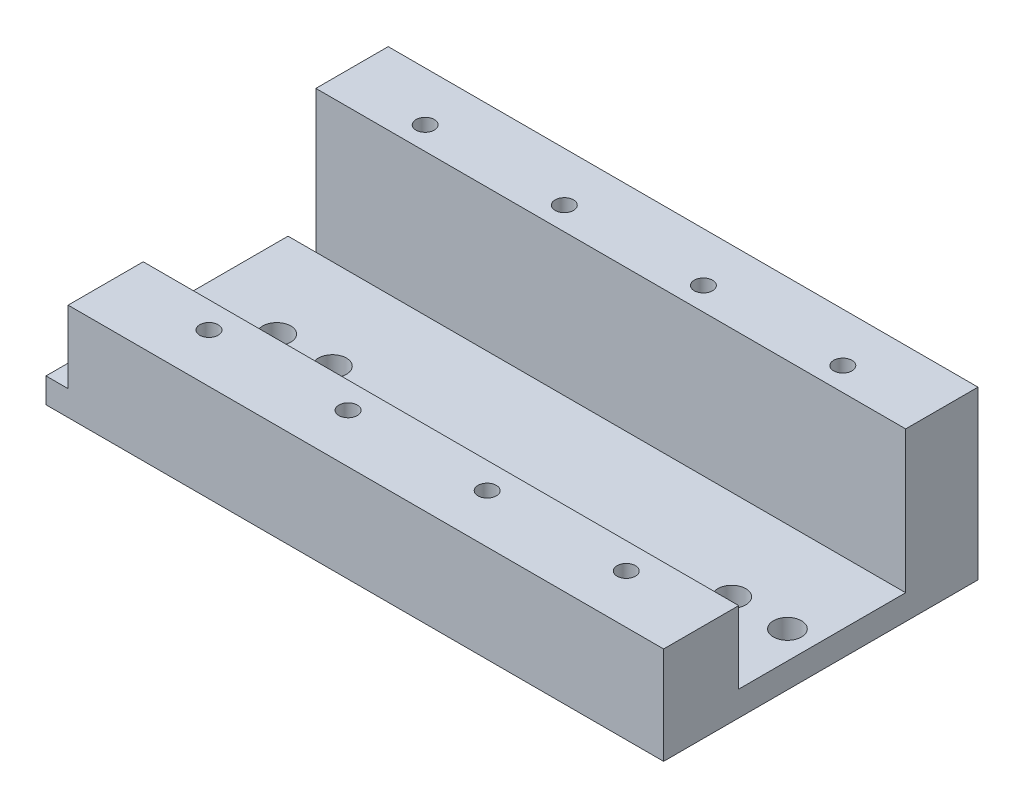
ISO-10303-21;
HEADER;
FILE_DESCRIPTION(('STEP AP214'),'2;1');
FILE_NAME('part.step','',(''),(''),'','','');
FILE_SCHEMA(('AUTOMOTIVE_DESIGN { 1 0 10303 214 1 1 1 1 }'));
ENDSEC;
DATA;
#1=APPLICATION_CONTEXT('core data for automotive mechanical design processes');
#2=APPLICATION_PROTOCOL_DEFINITION('international standard','automotive_design',2000,#1);
#3=PRODUCT_CONTEXT('',#1,'mechanical');
#4=PRODUCT('Part','Part','',(#3));
#5=PRODUCT_RELATED_PRODUCT_CATEGORY('part','',(#4));
#6=PRODUCT_DEFINITION_FORMATION('','',#4);
#7=PRODUCT_DEFINITION_CONTEXT('part definition',#1,'design');
#8=PRODUCT_DEFINITION('design','',#6,#7);
#9=PRODUCT_DEFINITION_SHAPE('','',#8);
#10=(LENGTH_UNIT() NAMED_UNIT(*) SI_UNIT(.MILLI.,.METRE.));
#11=(NAMED_UNIT(*) PLANE_ANGLE_UNIT() SI_UNIT($,.RADIAN.));
#12=(NAMED_UNIT(*) SI_UNIT($,.STERADIAN.) SOLID_ANGLE_UNIT());
#13=UNCERTAINTY_MEASURE_WITH_UNIT(LENGTH_MEASURE(1.E-05),#10,'distance_accuracy_value','');
#14=(GEOMETRIC_REPRESENTATION_CONTEXT(3) GLOBAL_UNCERTAINTY_ASSIGNED_CONTEXT((#13)) GLOBAL_UNIT_ASSIGNED_CONTEXT((#10,
#11,#12)) REPRESENTATION_CONTEXT('',''));
#15=CARTESIAN_POINT('',(0.,0.,0.));
#16=DIRECTION('',(0.,0.,1.));
#17=DIRECTION('',(1.,0.,0.));
#18=AXIS2_PLACEMENT_3D('',#15,#16,#17);
#19=CARTESIAN_POINT('',(-89.8910476017454,-50.3227629134366,-13.));
#20=DIRECTION('',(0.,-1.,0.));
#21=DIRECTION('',(0.,0.,-1.));
#22=AXIS2_PLACEMENT_3D('',#19,#20,#21);
#23=PLANE('',#22);
#24=CARTESIAN_POINT('',(-74.3910476017454,-50.3227629134366,34.71));
#25=DIRECTION('',(0.,-1.,0.));
#26=DIRECTION('',(0.,0.,-1.));
#27=AXIS2_PLACEMENT_3D('',#24,#25,#26);
#28=CIRCLE('',#27,1.65);
#29=CARTESIAN_POINT('',(-74.3910476017454,-50.3227629134366,33.06));
#30=VERTEX_POINT('',#29);
#31=EDGE_CURVE('E374',#30,#30,#28,.F.);
#32=ORIENTED_EDGE('',*,*,#31,.T.);
#33=EDGE_LOOP('',(#32));
#34=FACE_BOUND('',#33,.T.);
#35=CARTESIAN_POINT('',(-49.3910476017454,-50.3227629134366,34.71));
#36=DIRECTION('',(0.,-1.,0.));
#37=DIRECTION('',(0.,0.,-1.));
#38=AXIS2_PLACEMENT_3D('',#35,#36,#37);
#39=CIRCLE('',#38,1.65);
#40=CARTESIAN_POINT('',(-49.3910476017454,-50.3227629134366,33.06));
#41=VERTEX_POINT('',#40);
#42=EDGE_CURVE('E384',#41,#41,#39,.F.);
#43=ORIENTED_EDGE('',*,*,#42,.T.);
#44=EDGE_LOOP('',(#43));
#45=FACE_BOUND('',#44,.T.);
#46=CARTESIAN_POINT('',(0.608952398254592,-50.3227629134366,34.71));
#47=DIRECTION('',(0.,-1.,0.));
#48=DIRECTION('',(0.,0.,-1.));
#49=AXIS2_PLACEMENT_3D('',#46,#47,#48);
#50=CIRCLE('',#49,1.65);
#51=CARTESIAN_POINT('',(0.608952398254592,-50.3227629134366,33.06));
#52=VERTEX_POINT('',#51);
#53=EDGE_CURVE('E396',#52,#52,#50,.F.);
#54=ORIENTED_EDGE('',*,*,#53,.T.);
#55=EDGE_LOOP('',(#54));
#56=FACE_BOUND('',#55,.T.);
#57=CARTESIAN_POINT('',(-80.6690739035055,-50.3227629134366,16.25));
#58=DIRECTION('',(0.,1.,0.));
#59=DIRECTION('',(0.,0.,1.));
#60=AXIS2_PLACEMENT_3D('',#57,#58,#59);
#61=CIRCLE('',#60,2.5273);
#62=CARTESIAN_POINT('',(-80.6690739035055,-50.3227629134366,18.7773));
#63=VERTEX_POINT('',#62);
#64=EDGE_CURVE('E145',#63,#63,#61,.T.);
#65=ORIENTED_EDGE('',*,*,#64,.T.);
#66=EDGE_LOOP('',(#65));
#67=FACE_BOUND('',#66,.T.);
#68=CARTESIAN_POINT('',(11.1089523982546,-50.3227629134366,16.25));
#69=DIRECTION('',(0.,1.,0.));
#70=DIRECTION('',(0.,0.,1.));
#71=AXIS2_PLACEMENT_3D('',#68,#69,#70);
#72=CIRCLE('',#71,2.5273);
#73=CARTESIAN_POINT('',(11.1089523982546,-50.3227629134366,18.7773));
#74=VERTEX_POINT('',#73);
#75=EDGE_CURVE('E156',#74,#74,#72,.T.);
#76=ORIENTED_EDGE('',*,*,#75,.T.);
#77=EDGE_LOOP('',(#76));
#78=FACE_BOUND('',#77,.T.);
#79=CARTESIAN_POINT('',(1.10895239825459,-50.3227629134366,16.25));
#80=DIRECTION('',(0.,1.,0.));
#81=DIRECTION('',(0.,0.,1.));
#82=AXIS2_PLACEMENT_3D('',#79,#80,#81);
#83=CIRCLE('',#82,2.5273);
#84=CARTESIAN_POINT('',(1.10895239825459,-50.3227629134366,18.7773));
#85=VERTEX_POINT('',#84);
#86=EDGE_CURVE('E162',#85,#85,#83,.T.);
#87=ORIENTED_EDGE('',*,*,#86,.T.);
#88=EDGE_LOOP('',(#87));
#89=FACE_BOUND('',#88,.T.);
#90=CARTESIAN_POINT('',(-70.6690739035055,-50.3227629134366,16.25));
#91=DIRECTION('',(0.,1.,0.));
#92=DIRECTION('',(0.,0.,1.));
#93=AXIS2_PLACEMENT_3D('',#90,#91,#92);
#94=CIRCLE('',#93,2.5273);
#95=CARTESIAN_POINT('',(-70.6690739035055,-50.3227629134366,18.7773));
#96=VERTEX_POINT('',#95);
#97=EDGE_CURVE('E168',#96,#96,#94,.T.);
#98=ORIENTED_EDGE('',*,*,#97,.T.);
#99=EDGE_LOOP('',(#98));
#100=FACE_BOUND('',#99,.T.);
#101=CARTESIAN_POINT('',(-74.3909856023909,-50.3227629134366,-4.15));
#102=DIRECTION('',(0.,1.,0.));
#103=DIRECTION('',(0.,0.,1.));
#104=AXIS2_PLACEMENT_3D('',#101,#102,#103);
#105=CIRCLE('',#104,1.65);
#106=CARTESIAN_POINT('',(-74.3909856023909,-50.3227629134366,-2.5));
#107=VERTEX_POINT('',#106);
#108=EDGE_CURVE('E202',#107,#107,#105,.T.);
#109=ORIENTED_EDGE('',*,*,#108,.T.);
#110=EDGE_LOOP('',(#109));
#111=FACE_BOUND('',#110,.T.);
#112=CARTESIAN_POINT('',(-49.3909856023909,-50.3227629134366,-4.15));
#113=DIRECTION('',(0.,1.,0.));
#114=DIRECTION('',(0.,0.,1.));
#115=AXIS2_PLACEMENT_3D('',#112,#113,#114);
#116=CIRCLE('',#115,1.64999999999999);
#117=CARTESIAN_POINT('',(-49.3909856023909,-50.3227629134366,-2.50000000000001));
#118=VERTEX_POINT('',#117);
#119=EDGE_CURVE('E208',#118,#118,#116,.T.);
#120=ORIENTED_EDGE('',*,*,#119,.T.);
#121=EDGE_LOOP('',(#120));
#122=FACE_BOUND('',#121,.T.);
#123=CARTESIAN_POINT('',(0.608952398254592,-50.3227629134366,-4.20567731927571));
#124=DIRECTION('',(0.,1.,0.));
#125=DIRECTION('',(0.,0.,1.));
#126=AXIS2_PLACEMENT_3D('',#123,#124,#125);
#127=CIRCLE('',#126,1.64999999999999);
#128=CARTESIAN_POINT('',(0.608952398254592,-50.3227629134366,-2.55567731927571));
#129=VERTEX_POINT('',#128);
#130=EDGE_CURVE('E214',#129,#129,#127,.T.);
#131=ORIENTED_EDGE('',*,*,#130,.T.);
#132=EDGE_LOOP('',(#131));
#133=FACE_BOUND('',#132,.T.);
#134=CARTESIAN_POINT('',(-24.3909856023909,-50.3227629134366,-4.15));
#135=DIRECTION('',(0.,1.,0.));
#136=DIRECTION('',(0.,0.,1.));
#137=AXIS2_PLACEMENT_3D('',#134,#135,#136);
#138=CIRCLE('',#137,1.64999999999999);
#139=CARTESIAN_POINT('',(-24.3909856023909,-50.3227629134366,-2.50000000000001));
#140=VERTEX_POINT('',#139);
#141=EDGE_CURVE('E220',#140,#140,#138,.T.);
#142=ORIENTED_EDGE('',*,*,#141,.T.);
#143=EDGE_LOOP('',(#142));
#144=FACE_BOUND('',#143,.T.);
#145=DIRECTION('',(0.,0.,1.));
#146=VECTOR('',#145,1.);
#147=CARTESIAN_POINT('',(16.1089523982546,-50.3227629134366,-13.));
#148=LINE('',#147,#146);
#149=CARTESIAN_POINT('',(16.1089523982546,-50.3227629134366,-13.));
#150=VERTEX_POINT('',#149);
#151=CARTESIAN_POINT('',(16.1089523982546,-50.3227629134366,43.5));
#152=VERTEX_POINT('',#151);
#153=EDGE_CURVE('E244',#150,#152,#148,.T.);
#154=ORIENTED_EDGE('',*,*,#153,.T.);
#155=DIRECTION('',(1.,0.,0.));
#156=VECTOR('',#155,1.);
#157=CARTESIAN_POINT('',(-89.8910476017454,-50.3227629134366,43.5));
#158=LINE('',#157,#156);
#159=CARTESIAN_POINT('',(-94.8910476017454,-50.3227629134366,43.5));
#160=VERTEX_POINT('',#159);
#161=EDGE_CURVE('E192',#160,#152,#158,.T.);
#162=ORIENTED_EDGE('',*,*,#161,.F.);
#163=DIRECTION('',(0.,0.,1.));
#164=VECTOR('',#163,1.);
#165=CARTESIAN_POINT('',(-94.8910476017454,-50.3227629134366,0.));
#166=LINE('',#165,#164);
#167=CARTESIAN_POINT('',(-94.8910476017454,-50.3227629134366,0.));
#168=VERTEX_POINT('',#167);
#169=EDGE_CURVE('E175',#168,#160,#166,.T.);
#170=ORIENTED_EDGE('',*,*,#169,.F.);
#171=DIRECTION('',(1.,0.,0.));
#172=VECTOR('',#171,1.);
#173=CARTESIAN_POINT('',(-94.8910476017454,-50.3227629134366,0.));
#174=LINE('',#173,#172);
#175=CARTESIAN_POINT('',(-89.8910476017454,-50.3227629134366,0.));
#176=VERTEX_POINT('',#175);
#177=EDGE_CURVE('E188',#168,#176,#174,.T.);
#178=ORIENTED_EDGE('',*,*,#177,.T.);
#179=DIRECTION('',(0.,0.,1.));
#180=VECTOR('',#179,1.);
#181=CARTESIAN_POINT('',(-89.8910476017454,-50.3227629134366,-13.));
#182=LINE('',#181,#180);
#183=CARTESIAN_POINT('',(-89.8910476017454,-50.3227629134366,-13.));
#184=VERTEX_POINT('',#183);
#185=EDGE_CURVE('E40',#184,#176,#182,.T.);
#186=ORIENTED_EDGE('',*,*,#185,.F.);
#187=DIRECTION('',(1.,0.,0.));
#188=VECTOR('',#187,1.);
#189=CARTESIAN_POINT('',(-89.8910476017454,-50.3227629134366,-13.));
#190=LINE('',#189,#188);
#191=EDGE_CURVE('E227',#184,#150,#190,.T.);
#192=ORIENTED_EDGE('',*,*,#191,.T.);
#193=EDGE_LOOP('',(#154,#162,#170,#178,#186,#192));
#194=FACE_BOUND('',#193,.T.);
#195=CARTESIAN_POINT('',(-24.3910476017454,-50.3227629134366,34.71));
#196=DIRECTION('',(0.,-1.,0.));
#197=DIRECTION('',(0.,0.,-1.));
#198=AXIS2_PLACEMENT_3D('',#195,#196,#197);
#199=CIRCLE('',#198,1.65);
#200=CARTESIAN_POINT('',(-24.3910476017454,-50.3227629134366,33.06));
#201=VERTEX_POINT('',#200);
#202=EDGE_CURVE('E390',#201,#201,#199,.F.);
#203=ORIENTED_EDGE('',*,*,#202,.T.);
#204=EDGE_LOOP('',(#203));
#205=FACE_BOUND('',#204,.T.);
#206=ADVANCED_FACE('F36',(#34,#45,#56,#67,#78,#89,#100,#111,#122,#133,#144,#194,#205),#23,.T.);
#207=CARTESIAN_POINT('',(-89.8910476017454,-45.8227629134366,43.5));
#208=DIRECTION('',(0.,-1.,0.));
#209=DIRECTION('',(0.,0.,-1.));
#210=AXIS2_PLACEMENT_3D('',#207,#208,#209);
#211=PLANE('',#210);
#212=CARTESIAN_POINT('',(-70.6690739035055,-45.8227629134366,16.25));
#213=DIRECTION('',(0.,1.,0.));
#214=DIRECTION('',(0.,0.,1.));
#215=AXIS2_PLACEMENT_3D('',#212,#213,#214);
#216=CIRCLE('',#215,2.52729999999998);
#217=CARTESIAN_POINT('',(-70.6690739035055,-45.8227629134366,18.7773));
#218=VERTEX_POINT('',#217);
#219=EDGE_CURVE('E165',#218,#218,#216,.T.);
#220=ORIENTED_EDGE('',*,*,#219,.F.);
#221=EDGE_LOOP('',(#220));
#222=FACE_BOUND('',#221,.T.);
#223=CARTESIAN_POINT('',(1.10895239825459,-45.8227629134366,16.25));
#224=DIRECTION('',(0.,1.,0.));
#225=DIRECTION('',(0.,0.,1.));
#226=AXIS2_PLACEMENT_3D('',#223,#224,#225);
#227=CIRCLE('',#226,2.52729999999999);
#228=CARTESIAN_POINT('',(1.10895239825459,-45.8227629134366,18.7773));
#229=VERTEX_POINT('',#228);
#230=EDGE_CURVE('E159',#229,#229,#227,.T.);
#231=ORIENTED_EDGE('',*,*,#230,.F.);
#232=EDGE_LOOP('',(#231));
#233=FACE_BOUND('',#232,.T.);
#234=CARTESIAN_POINT('',(11.1089523982546,-45.8227629134366,16.25));
#235=DIRECTION('',(0.,1.,0.));
#236=DIRECTION('',(0.,0.,1.));
#237=AXIS2_PLACEMENT_3D('',#234,#235,#236);
#238=CIRCLE('',#237,2.52729999999999);
#239=CARTESIAN_POINT('',(11.1089523982546,-45.8227629134366,18.7773));
#240=VERTEX_POINT('',#239);
#241=EDGE_CURVE('E153',#240,#240,#238,.T.);
#242=ORIENTED_EDGE('',*,*,#241,.F.);
#243=EDGE_LOOP('',(#242));
#244=FACE_BOUND('',#243,.T.);
#245=CARTESIAN_POINT('',(-80.6690739035055,-45.8227629134366,16.25));
#246=DIRECTION('',(0.,1.,0.));
#247=DIRECTION('',(0.,0.,1.));
#248=AXIS2_PLACEMENT_3D('',#245,#246,#247);
#249=CIRCLE('',#248,2.52729999999998);
#250=CARTESIAN_POINT('',(-80.6690739035055,-45.8227629134366,18.7773));
#251=VERTEX_POINT('',#250);
#252=EDGE_CURVE('E141',#251,#251,#249,.T.);
#253=ORIENTED_EDGE('',*,*,#252,.F.);
#254=EDGE_LOOP('',(#253));
#255=FACE_BOUND('',#254,.T.);
#256=DIRECTION('',(0.,0.,1.));
#257=VECTOR('',#256,1.);
#258=CARTESIAN_POINT('',(-90.9181293095313,-45.8227629134366,43.5));
#259=LINE('',#258,#257);
#260=CARTESIAN_POINT('',(-90.9181293095313,-45.8227629134366,30.));
#261=VERTEX_POINT('',#260);
#262=CARTESIAN_POINT('',(-90.9181293095313,-45.8227629134366,43.5));
#263=VERTEX_POINT('',#262);
#264=EDGE_CURVE('E53',#261,#263,#259,.T.);
#265=ORIENTED_EDGE('',*,*,#264,.F.);
#266=DIRECTION('',(-1.,0.,0.));
#267=VECTOR('',#266,1.);
#268=CARTESIAN_POINT('',(-90.9181293095313,-45.8227629134366,30.));
#269=LINE('',#268,#267);
#270=CARTESIAN_POINT('',(16.1089523982546,-45.8227629134366,30.));
#271=VERTEX_POINT('',#270);
#272=EDGE_CURVE('E138',#271,#261,#269,.T.);
#273=ORIENTED_EDGE('',*,*,#272,.F.);
#274=DIRECTION('',(0.,0.,-1.));
#275=VECTOR('',#274,1.);
#276=CARTESIAN_POINT('',(16.1089523982546,-45.8227629134366,43.5));
#277=LINE('',#276,#275);
#278=CARTESIAN_POINT('',(16.1089523982546,-45.8227629134366,0.));
#279=VERTEX_POINT('',#278);
#280=EDGE_CURVE('E61',#271,#279,#277,.T.);
#281=ORIENTED_EDGE('',*,*,#280,.T.);
#282=DIRECTION('',(-1.,0.,0.));
#283=VECTOR('',#282,1.);
#284=CARTESIAN_POINT('',(-89.8910476017454,-45.8227629134366,0.));
#285=LINE('',#284,#283);
#286=CARTESIAN_POINT('',(-89.8910476017454,-45.8227629134366,0.));
#287=VERTEX_POINT('',#286);
#288=EDGE_CURVE('E191',#279,#287,#285,.T.);
#289=ORIENTED_EDGE('',*,*,#288,.T.);
#290=DIRECTION('',(1.,0.,0.));
#291=VECTOR('',#290,1.);
#292=CARTESIAN_POINT('',(-94.8910476017454,-45.8227629134366,0.));
#293=LINE('',#292,#291);
#294=CARTESIAN_POINT('',(-94.8910476017454,-45.8227629134366,0.));
#295=VERTEX_POINT('',#294);
#296=EDGE_CURVE('E183',#295,#287,#293,.T.);
#297=ORIENTED_EDGE('',*,*,#296,.F.);
#298=DIRECTION('',(0.,0.,-1.));
#299=VECTOR('',#298,1.);
#300=CARTESIAN_POINT('',(-94.8910476017454,-45.8227629134366,0.));
#301=LINE('',#300,#299);
#302=CARTESIAN_POINT('',(-94.8910476017454,-45.8227629134366,43.5));
#303=VERTEX_POINT('',#302);
#304=EDGE_CURVE('E181',#303,#295,#301,.T.);
#305=ORIENTED_EDGE('',*,*,#304,.F.);
#306=DIRECTION('',(-1.,0.,0.));
#307=VECTOR('',#306,1.);
#308=CARTESIAN_POINT('',(-89.8910476017454,-45.8227629134366,43.5));
#309=LINE('',#308,#307);
#310=EDGE_CURVE('E195',#263,#303,#309,.T.);
#311=ORIENTED_EDGE('',*,*,#310,.F.);
#312=EDGE_LOOP('',(#265,#273,#281,#289,#297,#305,#311));
#313=FACE_BOUND('',#312,.T.);
#314=ADVANCED_FACE('F257',(#222,#233,#244,#255,#313),#211,.F.);
#315=CARTESIAN_POINT('',(-89.8910476017454,-20.3227629134366,-13.));
#316=DIRECTION('',(-1.,0.,0.));
#317=DIRECTION('',(0.,0.,1.));
#318=AXIS2_PLACEMENT_3D('',#315,#316,#317);
#319=PLANE('',#318);
#320=DIRECTION('',(0.,-1.,0.));
#321=VECTOR('',#320,1.);
#322=CARTESIAN_POINT('',(-89.8910476017454,-45.8227629134366,0.));
#323=LINE('',#322,#321);
#324=EDGE_CURVE('E171',#287,#176,#323,.T.);
#325=ORIENTED_EDGE('',*,*,#324,.F.);
#326=DIRECTION('',(0.,-1.,0.));
#327=VECTOR('',#326,1.);
#328=CARTESIAN_POINT('',(-89.8910476017454,-20.3227629134366,0.));
#329=LINE('',#328,#327);
#330=CARTESIAN_POINT('',(-89.8910476017454,-20.3227629134366,0.));
#331=VERTEX_POINT('',#330);
#332=EDGE_CURVE('E223',#331,#287,#329,.T.);
#333=ORIENTED_EDGE('',*,*,#332,.F.);
#334=DIRECTION('',(0.,0.,1.));
#335=VECTOR('',#334,1.);
#336=CARTESIAN_POINT('',(-89.8910476017454,-20.3227629134366,-13.));
#337=LINE('',#336,#335);
#338=CARTESIAN_POINT('',(-89.8910476017454,-20.3227629134366,-13.));
#339=VERTEX_POINT('',#338);
#340=EDGE_CURVE('E11',#339,#331,#337,.T.);
#341=ORIENTED_EDGE('',*,*,#340,.F.);
#342=DIRECTION('',(0.,-1.,0.));
#343=VECTOR('',#342,1.);
#344=CARTESIAN_POINT('',(-89.8910476017454,-20.3227629134366,-13.));
#345=LINE('',#344,#343);
#346=EDGE_CURVE('E224',#339,#184,#345,.T.);
#347=ORIENTED_EDGE('',*,*,#346,.T.);
#348=ORIENTED_EDGE('',*,*,#185,.T.);
#349=EDGE_LOOP('',(#325,#333,#341,#347,#348));
#350=FACE_BOUND('',#349,.T.);
#351=ADVANCED_FACE('F38',(#350),#319,.T.);
#352=CARTESIAN_POINT('',(-89.8910476017454,-20.3227629134366,-13.));
#353=DIRECTION('',(0.,1.,0.));
#354=DIRECTION('',(0.,0.,1.));
#355=AXIS2_PLACEMENT_3D('',#352,#353,#354);
#356=PLANE('',#355);
#357=CARTESIAN_POINT('',(-74.3909856023909,-20.3227629134366,-4.15));
#358=DIRECTION('',(0.,1.,0.));
#359=DIRECTION('',(0.,0.,1.));
#360=AXIS2_PLACEMENT_3D('',#357,#358,#359);
#361=CIRCLE('',#360,1.65);
#362=CARTESIAN_POINT('',(-74.3909856023909,-20.3227629134366,-2.5));
#363=VERTEX_POINT('',#362);
#364=EDGE_CURVE('E199',#363,#363,#361,.T.);
#365=ORIENTED_EDGE('',*,*,#364,.F.);
#366=EDGE_LOOP('',(#365));
#367=FACE_BOUND('',#366,.T.);
#368=CARTESIAN_POINT('',(-49.3909856023909,-20.3227629134366,-4.15));
#369=DIRECTION('',(0.,1.,0.));
#370=DIRECTION('',(0.,0.,1.));
#371=AXIS2_PLACEMENT_3D('',#368,#369,#370);
#372=CIRCLE('',#371,1.65);
#373=CARTESIAN_POINT('',(-49.3909856023909,-20.3227629134366,-2.5));
#374=VERTEX_POINT('',#373);
#375=EDGE_CURVE('E205',#374,#374,#372,.T.);
#376=ORIENTED_EDGE('',*,*,#375,.F.);
#377=EDGE_LOOP('',(#376));
#378=FACE_BOUND('',#377,.T.);
#379=CARTESIAN_POINT('',(0.608952398254592,-20.3227629134366,-4.20567731927571));
#380=DIRECTION('',(0.,1.,0.));
#381=DIRECTION('',(0.,0.,1.));
#382=AXIS2_PLACEMENT_3D('',#379,#380,#381);
#383=CIRCLE('',#382,1.65);
#384=CARTESIAN_POINT('',(0.608952398254592,-20.3227629134366,-2.55567731927571));
#385=VERTEX_POINT('',#384);
#386=EDGE_CURVE('E211',#385,#385,#383,.T.);
#387=ORIENTED_EDGE('',*,*,#386,.F.);
#388=EDGE_LOOP('',(#387));
#389=FACE_BOUND('',#388,.T.);
#390=CARTESIAN_POINT('',(-24.3909856023909,-20.3227629134366,-4.15));
#391=DIRECTION('',(0.,1.,0.));
#392=DIRECTION('',(0.,0.,1.));
#393=AXIS2_PLACEMENT_3D('',#390,#391,#392);
#394=CIRCLE('',#393,1.65);
#395=CARTESIAN_POINT('',(-24.3909856023909,-20.3227629134366,-2.5));
#396=VERTEX_POINT('',#395);
#397=EDGE_CURVE('E217',#396,#396,#394,.T.);
#398=ORIENTED_EDGE('',*,*,#397,.F.);
#399=EDGE_LOOP('',(#398));
#400=FACE_BOUND('',#399,.T.);
#401=DIRECTION('',(-1.,0.,0.));
#402=VECTOR('',#401,1.);
#403=CARTESIAN_POINT('',(-89.8910476017454,-20.3227629134366,0.));
#404=LINE('',#403,#402);
#405=CARTESIAN_POINT('',(16.1089523982546,-20.3227629134366,0.));
#406=VERTEX_POINT('',#405);
#407=EDGE_CURVE('E228',#406,#331,#404,.T.);
#408=ORIENTED_EDGE('',*,*,#407,.F.);
#409=DIRECTION('',(0.,0.,1.));
#410=VECTOR('',#409,1.);
#411=CARTESIAN_POINT('',(16.1089523982546,-20.3227629134366,-13.));
#412=LINE('',#411,#410);
#413=CARTESIAN_POINT('',(16.1089523982546,-20.3227629134366,-13.));
#414=VERTEX_POINT('',#413);
#415=EDGE_CURVE('E45',#414,#406,#412,.T.);
#416=ORIENTED_EDGE('',*,*,#415,.F.);
#417=DIRECTION('',(-1.,0.,0.));
#418=VECTOR('',#417,1.);
#419=CARTESIAN_POINT('',(-89.8910476017454,-20.3227629134366,-13.));
#420=LINE('',#419,#418);
#421=EDGE_CURVE('E234',#414,#339,#420,.T.);
#422=ORIENTED_EDGE('',*,*,#421,.T.);
#423=ORIENTED_EDGE('',*,*,#340,.T.);
#424=EDGE_LOOP('',(#408,#416,#422,#423));
#425=FACE_BOUND('',#424,.T.);
#426=ADVANCED_FACE('F268',(#367,#378,#389,#400,#425),#356,.T.);
#427=CARTESIAN_POINT('',(16.1089523982546,-20.3227629134366,-13.));
#428=DIRECTION('',(1.,0.,0.));
#429=DIRECTION('',(0.,0.,-1.));
#430=AXIS2_PLACEMENT_3D('',#427,#428,#429);
#431=PLANE('',#430);
#432=DIRECTION('',(0.,1.,0.));
#433=VECTOR('',#432,1.);
#434=CARTESIAN_POINT('',(16.1089523982546,-20.3227629134366,0.));
#435=LINE('',#434,#433);
#436=EDGE_CURVE('E239',#279,#406,#435,.T.);
#437=ORIENTED_EDGE('',*,*,#436,.F.);
#438=ORIENTED_EDGE('',*,*,#280,.F.);
#439=DIRECTION('',(0.,-1.,0.));
#440=VECTOR('',#439,1.);
#441=CARTESIAN_POINT('',(16.1089523982546,-32.8227629134366,30.));
#442=LINE('',#441,#440);
#443=CARTESIAN_POINT('',(16.1089523982546,-32.8227629134366,30.));
#444=VERTEX_POINT('',#443);
#445=EDGE_CURVE('E142',#444,#271,#442,.T.);
#446=ORIENTED_EDGE('',*,*,#445,.F.);
#447=DIRECTION('',(0.,0.,-1.));
#448=VECTOR('',#447,1.);
#449=CARTESIAN_POINT('',(16.1089523982546,-32.8227629134366,43.5));
#450=LINE('',#449,#448);
#451=CARTESIAN_POINT('',(16.1089523982546,-32.8227629134366,43.5));
#452=VERTEX_POINT('',#451);
#453=EDGE_CURVE('E130',#452,#444,#450,.T.);
#454=ORIENTED_EDGE('',*,*,#453,.F.);
#455=DIRECTION('',(0.,1.,0.));
#456=VECTOR('',#455,1.);
#457=CARTESIAN_POINT('',(16.1089523982546,-45.8227629134366,43.5));
#458=LINE('',#457,#456);
#459=EDGE_CURVE('E127',#152,#452,#458,.T.);
#460=ORIENTED_EDGE('',*,*,#459,.F.);
#461=ORIENTED_EDGE('',*,*,#153,.F.);
#462=DIRECTION('',(0.,1.,0.));
#463=VECTOR('',#462,1.);
#464=CARTESIAN_POINT('',(16.1089523982546,-20.3227629134366,-13.));
#465=LINE('',#464,#463);
#466=EDGE_CURVE('E231',#150,#414,#465,.T.);
#467=ORIENTED_EDGE('',*,*,#466,.T.);
#468=ORIENTED_EDGE('',*,*,#415,.T.);
#469=EDGE_LOOP('',(#437,#438,#446,#454,#460,#461,#467,#468));
#470=FACE_BOUND('',#469,.T.);
#471=ADVANCED_FACE('F262',(#470),#431,.T.);
#472=CARTESIAN_POINT('',(0.,0.,-13.));
#473=DIRECTION('',(0.,0.,1.));
#474=DIRECTION('',(1.,0.,0.));
#475=AXIS2_PLACEMENT_3D('',#472,#473,#474);
#476=PLANE('',#475);
#477=ORIENTED_EDGE('',*,*,#346,.F.);
#478=ORIENTED_EDGE('',*,*,#421,.F.);
#479=ORIENTED_EDGE('',*,*,#466,.F.);
#480=ORIENTED_EDGE('',*,*,#191,.F.);
#481=EDGE_LOOP('',(#477,#478,#479,#480));
#482=FACE_BOUND('',#481,.T.);
#483=ADVANCED_FACE('F270',(#482),#476,.F.);
#484=CARTESIAN_POINT('',(0.,0.,0.));
#485=DIRECTION('',(0.,0.,1.));
#486=DIRECTION('',(1.,0.,0.));
#487=AXIS2_PLACEMENT_3D('',#484,#485,#486);
#488=PLANE('',#487);
#489=ORIENTED_EDGE('',*,*,#288,.F.);
#490=ORIENTED_EDGE('',*,*,#436,.T.);
#491=ORIENTED_EDGE('',*,*,#407,.T.);
#492=ORIENTED_EDGE('',*,*,#332,.T.);
#493=EDGE_LOOP('',(#489,#490,#491,#492));
#494=FACE_BOUND('',#493,.T.);
#495=ADVANCED_FACE('F260',(#494),#488,.T.);
#496=CARTESIAN_POINT('',(-24.3909856023909,-20.3227629134366,-4.15));
#497=DIRECTION('',(0.,1.,0.));
#498=DIRECTION('',(0.,0.,1.));
#499=AXIS2_PLACEMENT_3D('',#496,#497,#498);
#500=CYLINDRICAL_SURFACE('',#499,1.64999999999999);
#501=ORIENTED_EDGE('',*,*,#141,.F.);
#502=EDGE_LOOP('',(#501));
#503=FACE_BOUND('',#502,.T.);
#504=ORIENTED_EDGE('',*,*,#397,.T.);
#505=EDGE_LOOP('',(#504));
#506=FACE_BOUND('',#505,.T.);
#507=ADVANCED_FACE('F277',(#503,#506),#500,.F.);
#508=CARTESIAN_POINT('',(0.608952398254592,-20.3227629134366,-4.20567731927571));
#509=DIRECTION('',(0.,1.,0.));
#510=DIRECTION('',(0.,0.,1.));
#511=AXIS2_PLACEMENT_3D('',#508,#509,#510);
#512=CYLINDRICAL_SURFACE('',#511,1.64999999999999);
#513=ORIENTED_EDGE('',*,*,#130,.F.);
#514=EDGE_LOOP('',(#513));
#515=FACE_BOUND('',#514,.T.);
#516=ORIENTED_EDGE('',*,*,#386,.T.);
#517=EDGE_LOOP('',(#516));
#518=FACE_BOUND('',#517,.T.);
#519=ADVANCED_FACE('F305',(#515,#518),#512,.F.);
#520=CARTESIAN_POINT('',(-49.3909856023909,-20.3227629134366,-4.15));
#521=DIRECTION('',(0.,1.,0.));
#522=DIRECTION('',(0.,0.,1.));
#523=AXIS2_PLACEMENT_3D('',#520,#521,#522);
#524=CYLINDRICAL_SURFACE('',#523,1.65);
#525=ORIENTED_EDGE('',*,*,#119,.F.);
#526=EDGE_LOOP('',(#525));
#527=FACE_BOUND('',#526,.T.);
#528=ORIENTED_EDGE('',*,*,#375,.T.);
#529=EDGE_LOOP('',(#528));
#530=FACE_BOUND('',#529,.T.);
#531=ADVANCED_FACE('F310',(#527,#530),#524,.F.);
#532=CARTESIAN_POINT('',(-74.3909856023909,-20.3227629134366,-4.15));
#533=DIRECTION('',(0.,1.,0.));
#534=DIRECTION('',(0.,0.,1.));
#535=AXIS2_PLACEMENT_3D('',#532,#533,#534);
#536=CYLINDRICAL_SURFACE('',#535,1.65);
#537=ORIENTED_EDGE('',*,*,#108,.F.);
#538=EDGE_LOOP('',(#537));
#539=FACE_BOUND('',#538,.T.);
#540=ORIENTED_EDGE('',*,*,#364,.T.);
#541=EDGE_LOOP('',(#540));
#542=FACE_BOUND('',#541,.T.);
#543=ADVANCED_FACE('F317',(#539,#542),#536,.F.);
#544=CARTESIAN_POINT('',(0.,0.,43.5));
#545=DIRECTION('',(0.,0.,1.));
#546=DIRECTION('',(1.,0.,0.));
#547=AXIS2_PLACEMENT_3D('',#544,#545,#546);
#548=PLANE('',#547);
#549=ORIENTED_EDGE('',*,*,#459,.T.);
#550=DIRECTION('',(1.,0.,0.));
#551=VECTOR('',#550,1.);
#552=CARTESIAN_POINT('',(-90.9181293095313,-32.8227629134366,43.5));
#553=LINE('',#552,#551);
#554=CARTESIAN_POINT('',(-90.9181293095313,-32.8227629134366,43.5));
#555=VERTEX_POINT('',#554);
#556=EDGE_CURVE('E120',#555,#452,#553,.T.);
#557=ORIENTED_EDGE('',*,*,#556,.F.);
#558=DIRECTION('',(0.,-1.,0.));
#559=VECTOR('',#558,1.);
#560=CARTESIAN_POINT('',(-90.9181293095313,-32.8227629134366,43.5));
#561=LINE('',#560,#559);
#562=EDGE_CURVE('E123',#555,#263,#561,.T.);
#563=ORIENTED_EDGE('',*,*,#562,.T.);
#564=ORIENTED_EDGE('',*,*,#310,.T.);
#565=DIRECTION('',(0.,1.,0.));
#566=VECTOR('',#565,1.);
#567=CARTESIAN_POINT('',(-94.8910476017454,-45.8227629134366,43.5));
#568=LINE('',#567,#566);
#569=EDGE_CURVE('E178',#160,#303,#568,.T.);
#570=ORIENTED_EDGE('',*,*,#569,.F.);
#571=ORIENTED_EDGE('',*,*,#161,.T.);
#572=EDGE_LOOP('',(#549,#557,#563,#564,#570,#571));
#573=FACE_BOUND('',#572,.T.);
#574=ADVANCED_FACE('F122',(#573),#548,.T.);
#575=CARTESIAN_POINT('',(-94.8910476017454,-45.8227629134366,0.));
#576=DIRECTION('',(0.,0.,1.));
#577=DIRECTION('',(1.,0.,0.));
#578=AXIS2_PLACEMENT_3D('',#575,#576,#577);
#579=PLANE('',#578);
#580=ORIENTED_EDGE('',*,*,#324,.T.);
#581=ORIENTED_EDGE('',*,*,#177,.F.);
#582=DIRECTION('',(0.,-1.,0.));
#583=VECTOR('',#582,1.);
#584=CARTESIAN_POINT('',(-94.8910476017454,-45.8227629134366,0.));
#585=LINE('',#584,#583);
#586=EDGE_CURVE('E172',#295,#168,#585,.T.);
#587=ORIENTED_EDGE('',*,*,#586,.F.);
#588=ORIENTED_EDGE('',*,*,#296,.T.);
#589=EDGE_LOOP('',(#580,#581,#587,#588));
#590=FACE_BOUND('',#589,.T.);
#591=ADVANCED_FACE('F254',(#590),#579,.F.);
#592=CARTESIAN_POINT('',(-94.8910476017454,0.,0.));
#593=DIRECTION('',(-1.,0.,0.));
#594=DIRECTION('',(0.,0.,1.));
#595=AXIS2_PLACEMENT_3D('',#592,#593,#594);
#596=PLANE('',#595);
#597=ORIENTED_EDGE('',*,*,#586,.T.);
#598=ORIENTED_EDGE('',*,*,#169,.T.);
#599=ORIENTED_EDGE('',*,*,#569,.T.);
#600=ORIENTED_EDGE('',*,*,#304,.T.);
#601=EDGE_LOOP('',(#597,#598,#599,#600));
#602=FACE_BOUND('',#601,.T.);
#603=ADVANCED_FACE('F326',(#602),#596,.T.);
#604=CARTESIAN_POINT('',(-70.6690739035055,-45.8227629134366,16.25));
#605=DIRECTION('',(0.,1.,0.));
#606=DIRECTION('',(0.,0.,1.));
#607=AXIS2_PLACEMENT_3D('',#604,#605,#606);
#608=CYLINDRICAL_SURFACE('',#607,2.52729999999999);
#609=ORIENTED_EDGE('',*,*,#97,.F.);
#610=EDGE_LOOP('',(#609));
#611=FACE_BOUND('',#610,.T.);
#612=ORIENTED_EDGE('',*,*,#219,.T.);
#613=EDGE_LOOP('',(#612));
#614=FACE_BOUND('',#613,.T.);
#615=ADVANCED_FACE('F329',(#611,#614),#608,.F.);
#616=CARTESIAN_POINT('',(1.10895239825459,-45.8227629134366,16.25));
#617=DIRECTION('',(0.,1.,0.));
#618=DIRECTION('',(0.,0.,1.));
#619=AXIS2_PLACEMENT_3D('',#616,#617,#618);
#620=CYLINDRICAL_SURFACE('',#619,2.52729999999999);
#621=ORIENTED_EDGE('',*,*,#86,.F.);
#622=EDGE_LOOP('',(#621));
#623=FACE_BOUND('',#622,.T.);
#624=ORIENTED_EDGE('',*,*,#230,.T.);
#625=EDGE_LOOP('',(#624));
#626=FACE_BOUND('',#625,.T.);
#627=ADVANCED_FACE('F333',(#623,#626),#620,.F.);
#628=CARTESIAN_POINT('',(11.1089523982546,-45.8227629134366,16.25));
#629=DIRECTION('',(0.,1.,0.));
#630=DIRECTION('',(0.,0.,1.));
#631=AXIS2_PLACEMENT_3D('',#628,#629,#630);
#632=CYLINDRICAL_SURFACE('',#631,2.52729999999999);
#633=ORIENTED_EDGE('',*,*,#75,.F.);
#634=EDGE_LOOP('',(#633));
#635=FACE_BOUND('',#634,.T.);
#636=ORIENTED_EDGE('',*,*,#241,.T.);
#637=EDGE_LOOP('',(#636));
#638=FACE_BOUND('',#637,.T.);
#639=ADVANCED_FACE('F337',(#635,#638),#632,.F.);
#640=CARTESIAN_POINT('',(-80.6690739035055,-45.8227629134366,16.25));
#641=DIRECTION('',(0.,1.,0.));
#642=DIRECTION('',(0.,0.,1.));
#643=AXIS2_PLACEMENT_3D('',#640,#641,#642);
#644=CYLINDRICAL_SURFACE('',#643,2.52729999999999);
#645=ORIENTED_EDGE('',*,*,#64,.F.);
#646=EDGE_LOOP('',(#645));
#647=FACE_BOUND('',#646,.T.);
#648=ORIENTED_EDGE('',*,*,#252,.T.);
#649=EDGE_LOOP('',(#648));
#650=FACE_BOUND('',#649,.T.);
#651=ADVANCED_FACE('F341',(#647,#650),#644,.F.);
#652=CARTESIAN_POINT('',(-90.9181293095313,-32.8227629134366,43.5));
#653=DIRECTION('',(1.,0.,0.));
#654=DIRECTION('',(0.,0.,-1.));
#655=AXIS2_PLACEMENT_3D('',#652,#653,#654);
#656=PLANE('',#655);
#657=ORIENTED_EDGE('',*,*,#264,.T.);
#658=ORIENTED_EDGE('',*,*,#562,.F.);
#659=DIRECTION('',(0.,0.,1.));
#660=VECTOR('',#659,1.);
#661=CARTESIAN_POINT('',(-90.9181293095313,-32.8227629134366,43.5));
#662=LINE('',#661,#660);
#663=CARTESIAN_POINT('',(-90.9181293095313,-32.8227629134366,30.));
#664=VERTEX_POINT('',#663);
#665=EDGE_CURVE('E131',#664,#555,#662,.T.);
#666=ORIENTED_EDGE('',*,*,#665,.F.);
#667=DIRECTION('',(0.,-1.,0.));
#668=VECTOR('',#667,1.);
#669=CARTESIAN_POINT('',(-90.9181293095313,-32.8227629134366,30.));
#670=LINE('',#669,#668);
#671=EDGE_CURVE('E147',#664,#261,#670,.T.);
#672=ORIENTED_EDGE('',*,*,#671,.T.);
#673=EDGE_LOOP('',(#657,#658,#666,#672));
#674=FACE_BOUND('',#673,.T.);
#675=ADVANCED_FACE('F140',(#674),#656,.F.);
#676=CARTESIAN_POINT('',(-90.9181293095313,-32.8227629134366,30.));
#677=DIRECTION('',(0.,0.,1.));
#678=DIRECTION('',(1.,0.,0.));
#679=AXIS2_PLACEMENT_3D('',#676,#677,#678);
#680=PLANE('',#679);
#681=ORIENTED_EDGE('',*,*,#272,.T.);
#682=ORIENTED_EDGE('',*,*,#671,.F.);
#683=DIRECTION('',(-1.,0.,0.));
#684=VECTOR('',#683,1.);
#685=CARTESIAN_POINT('',(-90.9181293095313,-32.8227629134366,30.));
#686=LINE('',#685,#684);
#687=EDGE_CURVE('E136',#444,#664,#686,.T.);
#688=ORIENTED_EDGE('',*,*,#687,.F.);
#689=ORIENTED_EDGE('',*,*,#445,.T.);
#690=EDGE_LOOP('',(#681,#682,#688,#689));
#691=FACE_BOUND('',#690,.T.);
#692=ADVANCED_FACE('F348',(#691),#680,.F.);
#693=CARTESIAN_POINT('',(0.,-32.8227629134366,0.));
#694=DIRECTION('',(0.,-1.,0.));
#695=DIRECTION('',(0.,0.,-1.));
#696=AXIS2_PLACEMENT_3D('',#693,#694,#695);
#697=PLANE('',#696);
#698=CARTESIAN_POINT('',(-74.3910476017454,-32.8227629134366,34.71));
#699=DIRECTION('',(0.,1.,0.));
#700=DIRECTION('',(0.,0.,1.));
#701=AXIS2_PLACEMENT_3D('',#698,#699,#700);
#702=CIRCLE('',#701,1.65);
#703=CARTESIAN_POINT('',(-74.3910476017454,-32.8227629134366,36.36));
#704=VERTEX_POINT('',#703);
#705=EDGE_CURVE('E377',#704,#704,#702,.T.);
#706=ORIENTED_EDGE('',*,*,#705,.F.);
#707=EDGE_LOOP('',(#706));
#708=FACE_BOUND('',#707,.T.);
#709=CARTESIAN_POINT('',(-49.3910476017454,-32.8227629134366,34.71));
#710=DIRECTION('',(0.,1.,0.));
#711=DIRECTION('',(0.,0.,1.));
#712=AXIS2_PLACEMENT_3D('',#709,#710,#711);
#713=CIRCLE('',#712,1.65);
#714=CARTESIAN_POINT('',(-49.3910476017454,-32.8227629134366,36.36));
#715=VERTEX_POINT('',#714);
#716=EDGE_CURVE('E379',#715,#715,#713,.T.);
#717=ORIENTED_EDGE('',*,*,#716,.F.);
#718=EDGE_LOOP('',(#717));
#719=FACE_BOUND('',#718,.T.);
#720=CARTESIAN_POINT('',(-24.3910476017454,-32.8227629134366,34.71));
#721=DIRECTION('',(0.,1.,0.));
#722=DIRECTION('',(0.,0.,1.));
#723=AXIS2_PLACEMENT_3D('',#720,#721,#722);
#724=CIRCLE('',#723,1.65);
#725=CARTESIAN_POINT('',(-24.3910476017454,-32.8227629134366,36.36));
#726=VERTEX_POINT('',#725);
#727=EDGE_CURVE('E387',#726,#726,#724,.T.);
#728=ORIENTED_EDGE('',*,*,#727,.F.);
#729=EDGE_LOOP('',(#728));
#730=FACE_BOUND('',#729,.T.);
#731=CARTESIAN_POINT('',(0.608952398254592,-32.8227629134366,34.71));
#732=DIRECTION('',(0.,1.,0.));
#733=DIRECTION('',(0.,0.,1.));
#734=AXIS2_PLACEMENT_3D('',#731,#732,#733);
#735=CIRCLE('',#734,1.65);
#736=CARTESIAN_POINT('',(0.608952398254592,-32.8227629134366,36.36));
#737=VERTEX_POINT('',#736);
#738=EDGE_CURVE('E393',#737,#737,#735,.T.);
#739=ORIENTED_EDGE('',*,*,#738,.F.);
#740=EDGE_LOOP('',(#739));
#741=FACE_BOUND('',#740,.T.);
#742=ORIENTED_EDGE('',*,*,#665,.T.);
#743=ORIENTED_EDGE('',*,*,#556,.T.);
#744=ORIENTED_EDGE('',*,*,#453,.T.);
#745=ORIENTED_EDGE('',*,*,#687,.T.);
#746=EDGE_LOOP('',(#742,#743,#744,#745));
#747=FACE_BOUND('',#746,.T.);
#748=ADVANCED_FACE('F134',(#708,#719,#730,#741,#747),#697,.F.);
#749=CARTESIAN_POINT('',(0.608952398254592,-32.8227629134366,34.71));
#750=DIRECTION('',(0.,1.,0.));
#751=DIRECTION('',(0.,0.,1.));
#752=AXIS2_PLACEMENT_3D('',#749,#750,#751);
#753=CYLINDRICAL_SURFACE('',#752,1.65);
#754=ORIENTED_EDGE('',*,*,#53,.F.);
#755=EDGE_LOOP('',(#754));
#756=FACE_BOUND('',#755,.T.);
#757=ORIENTED_EDGE('',*,*,#738,.T.);
#758=EDGE_LOOP('',(#757));
#759=FACE_BOUND('',#758,.T.);
#760=ADVANCED_FACE('F354',(#756,#759),#753,.F.);
#761=CARTESIAN_POINT('',(-24.3910476017454,-32.8227629134366,34.71));
#762=DIRECTION('',(0.,1.,0.));
#763=DIRECTION('',(0.,0.,1.));
#764=AXIS2_PLACEMENT_3D('',#761,#762,#763);
#765=CYLINDRICAL_SURFACE('',#764,1.65);
#766=ORIENTED_EDGE('',*,*,#202,.F.);
#767=EDGE_LOOP('',(#766));
#768=FACE_BOUND('',#767,.T.);
#769=ORIENTED_EDGE('',*,*,#727,.T.);
#770=EDGE_LOOP('',(#769));
#771=FACE_BOUND('',#770,.T.);
#772=ADVANCED_FACE('F358',(#768,#771),#765,.F.);
#773=CARTESIAN_POINT('',(-49.3910476017454,-32.8227629134366,34.71));
#774=DIRECTION('',(0.,1.,0.));
#775=DIRECTION('',(0.,0.,1.));
#776=AXIS2_PLACEMENT_3D('',#773,#774,#775);
#777=CYLINDRICAL_SURFACE('',#776,1.65);
#778=ORIENTED_EDGE('',*,*,#42,.F.);
#779=EDGE_LOOP('',(#778));
#780=FACE_BOUND('',#779,.T.);
#781=ORIENTED_EDGE('',*,*,#716,.T.);
#782=EDGE_LOOP('',(#781));
#783=FACE_BOUND('',#782,.T.);
#784=ADVANCED_FACE('F362',(#780,#783),#777,.F.);
#785=CARTESIAN_POINT('',(-74.3910476017454,-32.8227629134366,34.71));
#786=DIRECTION('',(0.,1.,0.));
#787=DIRECTION('',(0.,0.,1.));
#788=AXIS2_PLACEMENT_3D('',#785,#786,#787);
#789=CYLINDRICAL_SURFACE('',#788,1.65);
#790=ORIENTED_EDGE('',*,*,#31,.F.);
#791=EDGE_LOOP('',(#790));
#792=FACE_BOUND('',#791,.T.);
#793=ORIENTED_EDGE('',*,*,#705,.T.);
#794=EDGE_LOOP('',(#793));
#795=FACE_BOUND('',#794,.T.);
#796=ADVANCED_FACE('F366',(#792,#795),#789,.F.);
#797=CLOSED_SHELL('',(#206,#314,#351,#426,#471,#483,#495,#507,#519,#531,#543,#574,#591,#603,
#615,#627,#639,#651,#675,#692,#748,#760,#772,#784,#796));
#798=MANIFOLD_SOLID_BREP('B2',#797);
#799=ADVANCED_BREP_SHAPE_REPRESENTATION('',(#18,#798),#14);
#800=SHAPE_DEFINITION_REPRESENTATION(#9,#799);
ENDSEC;
END-ISO-10303-21;
